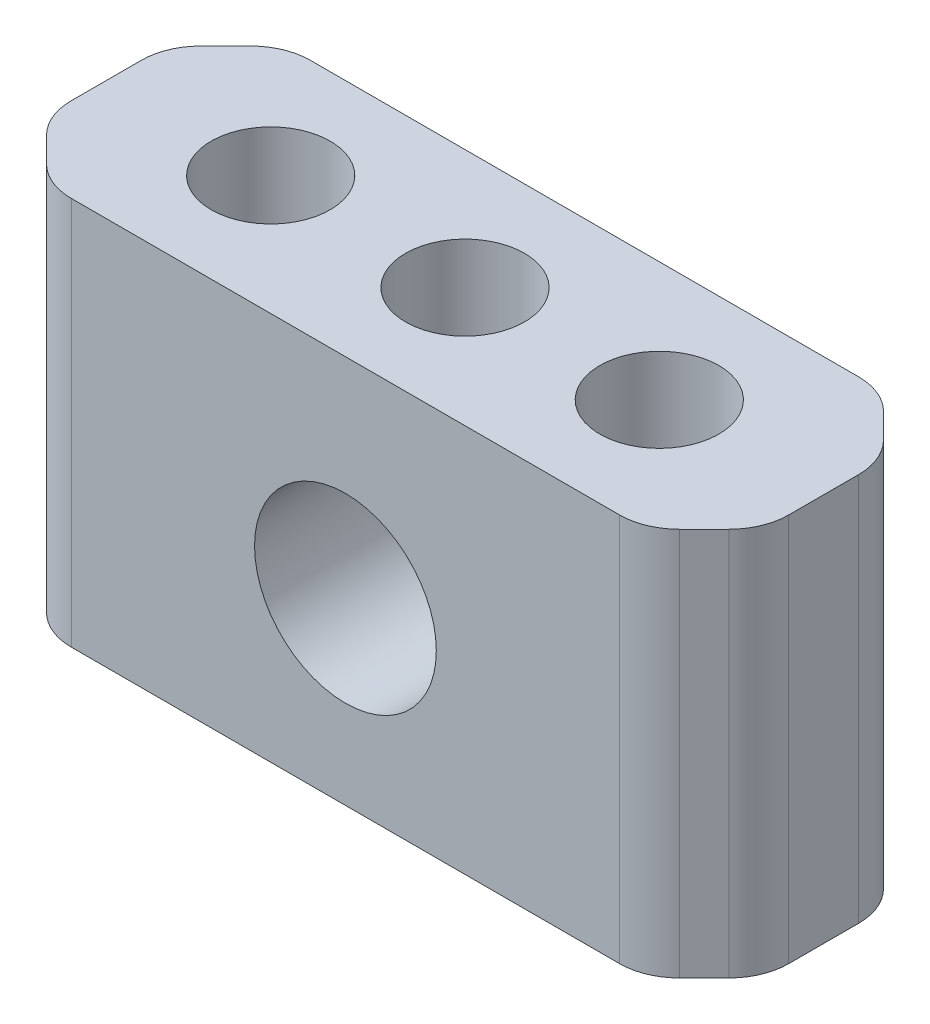
ISO-10303-21;
HEADER;
FILE_DESCRIPTION(('STEP AP214'),'2;1');
FILE_NAME('part.step','',(''),(''),'','','');
FILE_SCHEMA(('AUTOMOTIVE_DESIGN { 1 0 10303 214 1 1 1 1 }'));
ENDSEC;
DATA;
#1=APPLICATION_CONTEXT('core data for automotive mechanical design processes');
#2=APPLICATION_PROTOCOL_DEFINITION('international standard','automotive_design',2000,#1);
#3=PRODUCT_CONTEXT('',#1,'mechanical');
#4=PRODUCT('Part','Part','',(#3));
#5=PRODUCT_RELATED_PRODUCT_CATEGORY('part','',(#4));
#6=PRODUCT_DEFINITION_FORMATION('','',#4);
#7=PRODUCT_DEFINITION_CONTEXT('part definition',#1,'design');
#8=PRODUCT_DEFINITION('design','',#6,#7);
#9=PRODUCT_DEFINITION_SHAPE('','',#8);
#10=(LENGTH_UNIT() NAMED_UNIT(*) SI_UNIT(.MILLI.,.METRE.));
#11=(NAMED_UNIT(*) PLANE_ANGLE_UNIT() SI_UNIT($,.RADIAN.));
#12=(NAMED_UNIT(*) SI_UNIT($,.STERADIAN.) SOLID_ANGLE_UNIT());
#13=UNCERTAINTY_MEASURE_WITH_UNIT(LENGTH_MEASURE(1.E-05),#10,'distance_accuracy_value','');
#14=(GEOMETRIC_REPRESENTATION_CONTEXT(3) GLOBAL_UNCERTAINTY_ASSIGNED_CONTEXT((#13)) GLOBAL_UNIT_ASSIGNED_CONTEXT((#10,
#11,#12)) REPRESENTATION_CONTEXT('',''));
#15=CARTESIAN_POINT('',(0.,0.,0.));
#16=DIRECTION('',(0.,0.,1.));
#17=DIRECTION('',(1.,0.,0.));
#18=AXIS2_PLACEMENT_3D('',#15,#16,#17);
#19=CARTESIAN_POINT('',(-12.,6.5,-4.));
#20=DIRECTION('',(0.,0.,1.));
#21=DIRECTION('',(1.,0.,0.));
#22=AXIS2_PLACEMENT_3D('',#19,#20,#21);
#23=PLANE('',#22);
#24=DIRECTION('',(1.,0.,0.));
#25=VECTOR('',#24,1.);
#26=CARTESIAN_POINT('',(12.,-6.5,-4.));
#27=LINE('',#26,#25);
#28=CARTESIAN_POINT('',(-9.17157287525381,-6.5,-4.));
#29=VERTEX_POINT('',#28);
#30=CARTESIAN_POINT('',(9.1715728752538,-6.5,-4.));
#31=VERTEX_POINT('',#30);
#32=EDGE_CURVE('E176',#29,#31,#27,.T.);
#33=ORIENTED_EDGE('',*,*,#32,.F.);
#34=DIRECTION('',(0.,1.,0.));
#35=VECTOR('',#34,1.);
#36=CARTESIAN_POINT('',(-9.17157287525381,6.5,-4.));
#37=LINE('',#36,#35);
#38=CARTESIAN_POINT('',(-9.17157287525381,6.5,-4.));
#39=VERTEX_POINT('',#38);
#40=EDGE_CURVE('E270',#29,#39,#37,.T.);
#41=ORIENTED_EDGE('',*,*,#40,.T.);
#42=DIRECTION('',(-1.,0.,0.));
#43=VECTOR('',#42,1.);
#44=CARTESIAN_POINT('',(12.,6.5,-4.));
#45=LINE('',#44,#43);
#46=CARTESIAN_POINT('',(9.1715728752538,6.5,-4.));
#47=VERTEX_POINT('',#46);
#48=EDGE_CURVE('E184',#47,#39,#45,.T.);
#49=ORIENTED_EDGE('',*,*,#48,.F.);
#50=DIRECTION('',(0.,-1.,0.));
#51=VECTOR('',#50,1.);
#52=CARTESIAN_POINT('',(9.1715728752538,-6.5,-4.));
#53=LINE('',#52,#51);
#54=EDGE_CURVE('E267',#47,#31,#53,.T.);
#55=ORIENTED_EDGE('',*,*,#54,.T.);
#56=EDGE_LOOP('',(#33,#41,#49,#55));
#57=FACE_BOUND('',#56,.T.);
#58=CARTESIAN_POINT('',(0.,-0.5,-4.));
#59=DIRECTION('',(0.,0.,1.));
#60=DIRECTION('',(1.,0.,0.));
#61=AXIS2_PLACEMENT_3D('',#58,#59,#60);
#62=CIRCLE('',#61,3.04);
#63=CARTESIAN_POINT('',(3.04,-0.5,-4.));
#64=VERTEX_POINT('',#63);
#65=EDGE_CURVE('E174',#64,#64,#62,.F.);
#66=ORIENTED_EDGE('',*,*,#65,.F.);
#67=EDGE_LOOP('',(#66));
#68=FACE_BOUND('',#67,.T.);
#69=ADVANCED_FACE('F34',(#57,#68),#23,.F.);
#70=CARTESIAN_POINT('',(-12.,6.5,4.));
#71=DIRECTION('',(0.,0.,1.));
#72=DIRECTION('',(1.,0.,0.));
#73=AXIS2_PLACEMENT_3D('',#70,#71,#72);
#74=PLANE('',#73);
#75=DIRECTION('',(1.,0.,0.));
#76=VECTOR('',#75,1.);
#77=CARTESIAN_POINT('',(12.,-6.5,4.));
#78=LINE('',#77,#76);
#79=CARTESIAN_POINT('',(-9.17157287525381,-6.5,4.));
#80=VERTEX_POINT('',#79);
#81=CARTESIAN_POINT('',(9.17157287525381,-6.5,4.));
#82=VERTEX_POINT('',#81);
#83=EDGE_CURVE('E164',#80,#82,#78,.T.);
#84=ORIENTED_EDGE('',*,*,#83,.T.);
#85=DIRECTION('',(0.,-1.,0.));
#86=VECTOR('',#85,1.);
#87=CARTESIAN_POINT('',(9.17157287525381,6.5,4.));
#88=LINE('',#87,#86);
#89=CARTESIAN_POINT('',(9.17157287525381,6.5,4.));
#90=VERTEX_POINT('',#89);
#91=EDGE_CURVE('E168',#82,#90,#88,.F.);
#92=ORIENTED_EDGE('',*,*,#91,.T.);
#93=DIRECTION('',(-1.,0.,0.));
#94=VECTOR('',#93,1.);
#95=CARTESIAN_POINT('',(12.,6.5,4.));
#96=LINE('',#95,#94);
#97=CARTESIAN_POINT('',(-9.17157287525381,6.5,4.));
#98=VERTEX_POINT('',#97);
#99=EDGE_CURVE('E167',#90,#98,#96,.T.);
#100=ORIENTED_EDGE('',*,*,#99,.T.);
#101=DIRECTION('',(0.,1.,0.));
#102=VECTOR('',#101,1.);
#103=CARTESIAN_POINT('',(-9.17157287525381,6.5,4.));
#104=LINE('',#103,#102);
#105=EDGE_CURVE('E150',#98,#80,#104,.F.);
#106=ORIENTED_EDGE('',*,*,#105,.T.);
#107=EDGE_LOOP('',(#84,#92,#100,#106));
#108=FACE_BOUND('',#107,.T.);
#109=CARTESIAN_POINT('',(0.,-0.5,4.));
#110=DIRECTION('',(0.,0.,1.));
#111=DIRECTION('',(1.,0.,0.));
#112=AXIS2_PLACEMENT_3D('',#109,#110,#111);
#113=CIRCLE('',#112,3.04);
#114=CARTESIAN_POINT('',(3.04,-0.5,4.));
#115=VERTEX_POINT('',#114);
#116=EDGE_CURVE('E179',#115,#115,#113,.F.);
#117=ORIENTED_EDGE('',*,*,#116,.T.);
#118=EDGE_LOOP('',(#117));
#119=FACE_BOUND('',#118,.T.);
#120=ADVANCED_FACE('F161',(#108,#119),#74,.T.);
#121=CARTESIAN_POINT('',(-12.,-6.5,-4.));
#122=DIRECTION('',(-1.,0.,0.));
#123=DIRECTION('',(0.,0.,1.));
#124=AXIS2_PLACEMENT_3D('',#121,#122,#123);
#125=PLANE('',#124);
#126=DIRECTION('',(0.,0.,1.));
#127=VECTOR('',#126,1.);
#128=CARTESIAN_POINT('',(-12.,-6.5,-4.));
#129=LINE('',#128,#127);
#130=CARTESIAN_POINT('',(-12.,-6.5,-1.17157287525381));
#131=VERTEX_POINT('',#130);
#132=CARTESIAN_POINT('',(-12.,-6.5,1.1715728752538));
#133=VERTEX_POINT('',#132);
#134=EDGE_CURVE('E187',#131,#133,#129,.T.);
#135=ORIENTED_EDGE('',*,*,#134,.T.);
#136=DIRECTION('',(0.,-1.,0.));
#137=VECTOR('',#136,1.);
#138=CARTESIAN_POINT('',(-12.,-6.5,1.1715728752538));
#139=LINE('',#138,#137);
#140=CARTESIAN_POINT('',(-12.,6.5,1.1715728752538));
#141=VERTEX_POINT('',#140);
#142=EDGE_CURVE('E260',#133,#141,#139,.F.);
#143=ORIENTED_EDGE('',*,*,#142,.T.);
#144=DIRECTION('',(0.,0.,1.));
#145=VECTOR('',#144,1.);
#146=CARTESIAN_POINT('',(-12.,6.5,-4.));
#147=LINE('',#146,#145);
#148=CARTESIAN_POINT('',(-12.,6.5,-1.17157287525381));
#149=VERTEX_POINT('',#148);
#150=EDGE_CURVE('E188',#149,#141,#147,.T.);
#151=ORIENTED_EDGE('',*,*,#150,.F.);
#152=DIRECTION('',(0.,-1.,0.));
#153=VECTOR('',#152,1.);
#154=CARTESIAN_POINT('',(-12.,-6.5,-1.17157287525381));
#155=LINE('',#154,#153);
#156=EDGE_CURVE('E257',#149,#131,#155,.T.);
#157=ORIENTED_EDGE('',*,*,#156,.T.);
#158=EDGE_LOOP('',(#135,#143,#151,#157));
#159=FACE_BOUND('',#158,.T.);
#160=ADVANCED_FACE('F306',(#159),#125,.T.);
#161=CARTESIAN_POINT('',(12.,6.5,-4.));
#162=DIRECTION('',(0.,1.,0.));
#163=DIRECTION('',(-1.,0.,0.));
#164=AXIS2_PLACEMENT_3D('',#161,#162,#163);
#165=PLANE('',#164);
#166=CARTESIAN_POINT('',(0.,6.5,0.));
#167=DIRECTION('',(0.,1.,0.));
#168=DIRECTION('',(-1.,0.,0.));
#169=AXIS2_PLACEMENT_3D('',#166,#167,#168);
#170=CIRCLE('',#169,1.99);
#171=CARTESIAN_POINT('',(-1.99,6.5,0.));
#172=VERTEX_POINT('',#171);
#173=EDGE_CURVE('E567',#172,#172,#170,.T.);
#174=ORIENTED_EDGE('',*,*,#173,.F.);
#175=EDGE_LOOP('',(#174));
#176=FACE_BOUND('',#175,.T.);
#177=CARTESIAN_POINT('',(6.5,6.5,0.));
#178=DIRECTION('',(0.,1.,0.));
#179=DIRECTION('',(0.,0.,-1.));
#180=AXIS2_PLACEMENT_3D('',#177,#178,#179);
#181=CIRCLE('',#180,1.99);
#182=CARTESIAN_POINT('',(6.5,6.5,-1.99));
#183=VERTEX_POINT('',#182);
#184=EDGE_CURVE('E561',#183,#183,#181,.T.);
#185=ORIENTED_EDGE('',*,*,#184,.F.);
#186=EDGE_LOOP('',(#185));
#187=FACE_BOUND('',#186,.T.);
#188=CARTESIAN_POINT('',(-6.5,6.5,0.));
#189=DIRECTION('',(0.,1.,0.));
#190=DIRECTION('',(0.,0.,1.));
#191=AXIS2_PLACEMENT_3D('',#188,#189,#190);
#192=CIRCLE('',#191,1.99);
#193=CARTESIAN_POINT('',(-6.5,6.5,1.99));
#194=VERTEX_POINT('',#193);
#195=EDGE_CURVE('E556',#194,#194,#192,.T.);
#196=ORIENTED_EDGE('',*,*,#195,.F.);
#197=EDGE_LOOP('',(#196));
#198=FACE_BOUND('',#197,.T.);
#199=ORIENTED_EDGE('',*,*,#99,.F.);
#200=CARTESIAN_POINT('',(9.17157287525381,6.5,2.));
#201=DIRECTION('',(0.,1.,0.));
#202=DIRECTION('',(-1.,0.,0.));
#203=AXIS2_PLACEMENT_3D('',#200,#201,#202);
#204=CIRCLE('',#203,2.);
#205=CARTESIAN_POINT('',(10.5857864376269,6.5,3.41421356237309));
#206=VERTEX_POINT('',#205);
#207=EDGE_CURVE('E237',#90,#206,#204,.T.);
#208=ORIENTED_EDGE('',*,*,#207,.T.);
#209=DIRECTION('',(-0.707106781186546,0.,0.707106781186549));
#210=VECTOR('',#209,1.);
#211=CARTESIAN_POINT('',(15.,6.5,-1.00000000000001));
#212=LINE('',#211,#210);
#213=CARTESIAN_POINT('',(11.4142135623731,6.5,2.5857864376269));
#214=VERTEX_POINT('',#213);
#215=EDGE_CURVE('E211',#206,#214,#212,.F.);
#216=ORIENTED_EDGE('',*,*,#215,.T.);
#217=CARTESIAN_POINT('',(10.,6.5,1.17157287525381));
#218=DIRECTION('',(0.,1.,0.));
#219=DIRECTION('',(-1.,0.,0.));
#220=AXIS2_PLACEMENT_3D('',#217,#218,#219);
#221=CIRCLE('',#220,2.);
#222=CARTESIAN_POINT('',(12.,6.5,1.17157287525381));
#223=VERTEX_POINT('',#222);
#224=EDGE_CURVE('E227',#214,#223,#221,.T.);
#225=ORIENTED_EDGE('',*,*,#224,.T.);
#226=DIRECTION('',(0.,0.,1.));
#227=VECTOR('',#226,1.);
#228=CARTESIAN_POINT('',(12.,6.5,-4.));
#229=LINE('',#228,#227);
#230=CARTESIAN_POINT('',(12.,6.5,-1.17157287525381));
#231=VERTEX_POINT('',#230);
#232=EDGE_CURVE('E192',#231,#223,#229,.T.);
#233=ORIENTED_EDGE('',*,*,#232,.F.);
#234=CARTESIAN_POINT('',(10.,6.5,-1.17157287525381));
#235=DIRECTION('',(0.,1.,0.));
#236=DIRECTION('',(-1.,0.,0.));
#237=AXIS2_PLACEMENT_3D('',#234,#235,#236);
#238=CIRCLE('',#237,2.);
#239=CARTESIAN_POINT('',(11.4142135623731,6.5,-2.5857864376269));
#240=VERTEX_POINT('',#239);
#241=EDGE_CURVE('E225',#231,#240,#238,.T.);
#242=ORIENTED_EDGE('',*,*,#241,.T.);
#243=DIRECTION('',(-0.707106781186549,0.,-0.707106781186546));
#244=VECTOR('',#243,1.);
#245=CARTESIAN_POINT('',(11.,6.5,-3.));
#246=LINE('',#245,#244);
#247=CARTESIAN_POINT('',(10.5857864376269,6.5,-3.4142135623731));
#248=VERTEX_POINT('',#247);
#249=EDGE_CURVE('E208',#240,#248,#246,.T.);
#250=ORIENTED_EDGE('',*,*,#249,.T.);
#251=CARTESIAN_POINT('',(9.1715728752538,6.5,-2.));
#252=DIRECTION('',(0.,1.,0.));
#253=DIRECTION('',(-1.,0.,0.));
#254=AXIS2_PLACEMENT_3D('',#251,#252,#253);
#255=CIRCLE('',#254,2.);
#256=EDGE_CURVE('E223',#248,#47,#255,.T.);
#257=ORIENTED_EDGE('',*,*,#256,.T.);
#258=ORIENTED_EDGE('',*,*,#48,.T.);
#259=CARTESIAN_POINT('',(-9.17157287525381,6.5,-2.));
#260=DIRECTION('',(0.,1.,0.));
#261=DIRECTION('',(-1.,0.,0.));
#262=AXIS2_PLACEMENT_3D('',#259,#260,#261);
#263=CIRCLE('',#262,2.);
#264=CARTESIAN_POINT('',(-10.5857864376269,6.5,-3.4142135623731));
#265=VERTEX_POINT('',#264);
#266=EDGE_CURVE('E229',#39,#265,#263,.T.);
#267=ORIENTED_EDGE('',*,*,#266,.T.);
#268=DIRECTION('',(-0.707106781186549,0.,0.707106781186546));
#269=VECTOR('',#268,1.);
#270=CARTESIAN_POINT('',(1.00000000000004,6.5,-15.));
#271=LINE('',#270,#269);
#272=CARTESIAN_POINT('',(-11.4142135623731,6.5,-2.5857864376269));
#273=VERTEX_POINT('',#272);
#274=EDGE_CURVE('E191',#265,#273,#271,.T.);
#275=ORIENTED_EDGE('',*,*,#274,.T.);
#276=CARTESIAN_POINT('',(-10.,6.5,-1.17157287525381));
#277=DIRECTION('',(0.,1.,0.));
#278=DIRECTION('',(-1.,0.,0.));
#279=AXIS2_PLACEMENT_3D('',#276,#277,#278);
#280=CIRCLE('',#279,2.);
#281=EDGE_CURVE('E231',#273,#149,#280,.T.);
#282=ORIENTED_EDGE('',*,*,#281,.T.);
#283=ORIENTED_EDGE('',*,*,#150,.T.);
#284=CARTESIAN_POINT('',(-10.,6.5,1.1715728752538));
#285=DIRECTION('',(0.,1.,0.));
#286=DIRECTION('',(-1.,0.,0.));
#287=AXIS2_PLACEMENT_3D('',#284,#285,#286);
#288=CIRCLE('',#287,2.);
#289=CARTESIAN_POINT('',(-11.4142135623731,6.5,2.58578643762689));
#290=VERTEX_POINT('',#289);
#291=EDGE_CURVE('E233',#141,#290,#288,.T.);
#292=ORIENTED_EDGE('',*,*,#291,.T.);
#293=DIRECTION('',(-0.707106781186546,0.,-0.707106781186549));
#294=VECTOR('',#293,1.);
#295=CARTESIAN_POINT('',(-3.00000000000004,6.5,11.));
#296=LINE('',#295,#294);
#297=CARTESIAN_POINT('',(-10.5857864376269,6.5,3.41421356237309));
#298=VERTEX_POINT('',#297);
#299=EDGE_CURVE('E205',#290,#298,#296,.F.);
#300=ORIENTED_EDGE('',*,*,#299,.T.);
#301=CARTESIAN_POINT('',(-9.17157287525381,6.5,2.));
#302=DIRECTION('',(0.,1.,0.));
#303=DIRECTION('',(-1.,0.,0.));
#304=AXIS2_PLACEMENT_3D('',#301,#302,#303);
#305=CIRCLE('',#304,2.);
#306=EDGE_CURVE('E235',#298,#98,#305,.T.);
#307=ORIENTED_EDGE('',*,*,#306,.T.);
#308=EDGE_LOOP('',(#199,#208,#216,#225,#233,#242,#250,#257,#258,#267,#275,#282,#283,#292,#300,#307));
#309=FACE_BOUND('',#308,.T.);
#310=ADVANCED_FACE('F283',(#176,#187,#198,#309),#165,.T.);
#311=CARTESIAN_POINT('',(12.,-6.5,-4.));
#312=DIRECTION('',(1.,0.,0.));
#313=DIRECTION('',(0.,0.,-1.));
#314=AXIS2_PLACEMENT_3D('',#311,#312,#313);
#315=PLANE('',#314);
#316=ORIENTED_EDGE('',*,*,#232,.T.);
#317=DIRECTION('',(0.,1.,0.));
#318=VECTOR('',#317,1.);
#319=CARTESIAN_POINT('',(12.,-6.5,1.17157287525381));
#320=LINE('',#319,#318);
#321=CARTESIAN_POINT('',(12.,-6.5,1.17157287525381));
#322=VERTEX_POINT('',#321);
#323=EDGE_CURVE('E276',#223,#322,#320,.F.);
#324=ORIENTED_EDGE('',*,*,#323,.T.);
#325=DIRECTION('',(0.,0.,1.));
#326=VECTOR('',#325,1.);
#327=CARTESIAN_POINT('',(12.,-6.5,-4.));
#328=LINE('',#327,#326);
#329=CARTESIAN_POINT('',(12.,-6.5,-1.17157287525381));
#330=VERTEX_POINT('',#329);
#331=EDGE_CURVE('E195',#330,#322,#328,.T.);
#332=ORIENTED_EDGE('',*,*,#331,.F.);
#333=DIRECTION('',(0.,1.,0.));
#334=VECTOR('',#333,1.);
#335=CARTESIAN_POINT('',(12.,-6.5,-1.17157287525381));
#336=LINE('',#335,#334);
#337=EDGE_CURVE('E273',#330,#231,#336,.T.);
#338=ORIENTED_EDGE('',*,*,#337,.T.);
#339=EDGE_LOOP('',(#316,#324,#332,#338));
#340=FACE_BOUND('',#339,.T.);
#341=ADVANCED_FACE('F336',(#340),#315,.T.);
#342=CARTESIAN_POINT('',(12.,-6.5,-4.));
#343=DIRECTION('',(0.,-1.,0.));
#344=DIRECTION('',(1.,0.,0.));
#345=AXIS2_PLACEMENT_3D('',#342,#343,#344);
#346=PLANE('',#345);
#347=DIRECTION('',(0.707106781186546,0.,-0.707106781186549));
#348=VECTOR('',#347,1.);
#349=CARTESIAN_POINT('',(15.,-6.5,-1.00000000000001));
#350=LINE('',#349,#348);
#351=CARTESIAN_POINT('',(11.4142135623731,-6.5,2.5857864376269));
#352=VERTEX_POINT('',#351);
#353=CARTESIAN_POINT('',(10.5857864376269,-6.5,3.41421356237309));
#354=VERTEX_POINT('',#353);
#355=EDGE_CURVE('E169',#352,#354,#350,.F.);
#356=ORIENTED_EDGE('',*,*,#355,.T.);
#357=CARTESIAN_POINT('',(9.17157287525381,-6.5,2.));
#358=DIRECTION('',(0.,-1.,0.));
#359=DIRECTION('',(1.,0.,0.));
#360=AXIS2_PLACEMENT_3D('',#357,#358,#359);
#361=CIRCLE('',#360,2.);
#362=EDGE_CURVE('E155',#354,#82,#361,.T.);
#363=ORIENTED_EDGE('',*,*,#362,.T.);
#364=ORIENTED_EDGE('',*,*,#83,.F.);
#365=CARTESIAN_POINT('',(-9.17157287525381,-6.5,2.));
#366=DIRECTION('',(0.,-1.,0.));
#367=DIRECTION('',(1.,0.,0.));
#368=AXIS2_PLACEMENT_3D('',#365,#366,#367);
#369=CIRCLE('',#368,2.);
#370=CARTESIAN_POINT('',(-10.5857864376269,-6.5,3.41421356237309));
#371=VERTEX_POINT('',#370);
#372=EDGE_CURVE('E146',#80,#371,#369,.T.);
#373=ORIENTED_EDGE('',*,*,#372,.T.);
#374=DIRECTION('',(0.707106781186546,0.,0.707106781186549));
#375=VECTOR('',#374,1.);
#376=CARTESIAN_POINT('',(-3.00000000000004,-6.5,11.));
#377=LINE('',#376,#375);
#378=CARTESIAN_POINT('',(-11.4142135623731,-6.5,2.58578643762689));
#379=VERTEX_POINT('',#378);
#380=EDGE_CURVE('E217',#371,#379,#377,.F.);
#381=ORIENTED_EDGE('',*,*,#380,.T.);
#382=CARTESIAN_POINT('',(-10.,-6.5,1.1715728752538));
#383=DIRECTION('',(0.,-1.,0.));
#384=DIRECTION('',(1.,0.,0.));
#385=AXIS2_PLACEMENT_3D('',#382,#383,#384);
#386=CIRCLE('',#385,2.);
#387=EDGE_CURVE('E156',#379,#133,#386,.T.);
#388=ORIENTED_EDGE('',*,*,#387,.T.);
#389=ORIENTED_EDGE('',*,*,#134,.F.);
#390=CARTESIAN_POINT('',(-10.,-6.5,-1.17157287525381));
#391=DIRECTION('',(0.,-1.,0.));
#392=DIRECTION('',(1.,0.,0.));
#393=AXIS2_PLACEMENT_3D('',#390,#391,#392);
#394=CIRCLE('',#393,2.);
#395=CARTESIAN_POINT('',(-11.4142135623731,-6.5,-2.5857864376269));
#396=VERTEX_POINT('',#395);
#397=EDGE_CURVE('E250',#131,#396,#394,.T.);
#398=ORIENTED_EDGE('',*,*,#397,.T.);
#399=DIRECTION('',(0.707106781186549,0.,-0.707106781186546));
#400=VECTOR('',#399,1.);
#401=CARTESIAN_POINT('',(1.00000000000004,-6.5,-15.));
#402=LINE('',#401,#400);
#403=CARTESIAN_POINT('',(-10.5857864376269,-6.5,-3.4142135623731));
#404=VERTEX_POINT('',#403);
#405=EDGE_CURVE('E214',#396,#404,#402,.T.);
#406=ORIENTED_EDGE('',*,*,#405,.T.);
#407=CARTESIAN_POINT('',(-9.17157287525381,-6.5,-2.));
#408=DIRECTION('',(0.,-1.,0.));
#409=DIRECTION('',(1.,0.,0.));
#410=AXIS2_PLACEMENT_3D('',#407,#408,#409);
#411=CIRCLE('',#410,2.);
#412=EDGE_CURVE('E248',#404,#29,#411,.T.);
#413=ORIENTED_EDGE('',*,*,#412,.T.);
#414=ORIENTED_EDGE('',*,*,#32,.T.);
#415=CARTESIAN_POINT('',(9.1715728752538,-6.5,-2.));
#416=DIRECTION('',(0.,-1.,0.));
#417=DIRECTION('',(1.,0.,0.));
#418=AXIS2_PLACEMENT_3D('',#415,#416,#417);
#419=CIRCLE('',#418,2.);
#420=CARTESIAN_POINT('',(10.5857864376269,-6.5,-3.4142135623731));
#421=VERTEX_POINT('',#420);
#422=EDGE_CURVE('E54',#31,#421,#419,.T.);
#423=ORIENTED_EDGE('',*,*,#422,.T.);
#424=DIRECTION('',(0.707106781186549,0.,0.707106781186546));
#425=VECTOR('',#424,1.);
#426=CARTESIAN_POINT('',(11.,-6.5,-3.));
#427=LINE('',#426,#425);
#428=CARTESIAN_POINT('',(11.4142135623731,-6.5,-2.5857864376269));
#429=VERTEX_POINT('',#428);
#430=EDGE_CURVE('E219',#421,#429,#427,.T.);
#431=ORIENTED_EDGE('',*,*,#430,.T.);
#432=CARTESIAN_POINT('',(10.,-6.5,-1.17157287525381));
#433=DIRECTION('',(0.,-1.,0.));
#434=DIRECTION('',(1.,0.,0.));
#435=AXIS2_PLACEMENT_3D('',#432,#433,#434);
#436=CIRCLE('',#435,2.);
#437=EDGE_CURVE('E244',#429,#330,#436,.T.);
#438=ORIENTED_EDGE('',*,*,#437,.T.);
#439=ORIENTED_EDGE('',*,*,#331,.T.);
#440=CARTESIAN_POINT('',(10.,-6.5,1.17157287525381));
#441=DIRECTION('',(0.,-1.,0.));
#442=DIRECTION('',(1.,0.,0.));
#443=AXIS2_PLACEMENT_3D('',#440,#441,#442);
#444=CIRCLE('',#443,2.);
#445=EDGE_CURVE('E246',#322,#352,#444,.T.);
#446=ORIENTED_EDGE('',*,*,#445,.T.);
#447=EDGE_LOOP('',(#356,#363,#364,#373,#381,#388,#389,#398,#406,#413,#414,#423,#431,#438,#439,#446));
#448=FACE_BOUND('',#447,.T.);
#449=ADVANCED_FACE('F172',(#448),#346,.T.);
#450=CARTESIAN_POINT('',(0.,-0.5,7.));
#451=DIRECTION('',(0.,0.,-1.));
#452=DIRECTION('',(-1.,0.,0.));
#453=AXIS2_PLACEMENT_3D('',#450,#451,#452);
#454=CYLINDRICAL_SURFACE('',#453,3.04);
#455=ORIENTED_EDGE('',*,*,#116,.F.);
#456=EDGE_LOOP('',(#455));
#457=FACE_BOUND('',#456,.T.);
#458=ORIENTED_EDGE('',*,*,#65,.T.);
#459=EDGE_LOOP('',(#458));
#460=FACE_BOUND('',#459,.T.);
#461=ADVANCED_FACE('F343',(#457,#460),#454,.F.);
#462=CARTESIAN_POINT('',(-6.5,-3.5,0.));
#463=DIRECTION('',(0.,1.,0.));
#464=DIRECTION('',(0.,0.,1.));
#465=AXIS2_PLACEMENT_3D('',#462,#463,#464);
#466=CYLINDRICAL_SURFACE('',#465,1.99);
#467=CARTESIAN_POINT('',(-6.5,-3.5,0.));
#468=DIRECTION('',(0.,1.,0.));
#469=DIRECTION('',(0.,0.,1.));
#470=AXIS2_PLACEMENT_3D('',#467,#468,#469);
#471=CIRCLE('',#470,1.99);
#472=CARTESIAN_POINT('',(-6.5,-3.5,1.99));
#473=VERTEX_POINT('',#472);
#474=EDGE_CURVE('E202',#473,#473,#471,.T.);
#475=ORIENTED_EDGE('',*,*,#474,.F.);
#476=EDGE_LOOP('',(#475));
#477=FACE_BOUND('',#476,.T.);
#478=ORIENTED_EDGE('',*,*,#195,.T.);
#479=EDGE_LOOP('',(#478));
#480=FACE_BOUND('',#479,.T.);
#481=ADVANCED_FACE('F528',(#477,#480),#466,.F.);
#482=CARTESIAN_POINT('',(-6.5,-3.5,0.));
#483=DIRECTION('',(0.,1.,0.));
#484=DIRECTION('',(0.,0.,1.));
#485=AXIS2_PLACEMENT_3D('',#482,#483,#484);
#486=PLANE('',#485);
#487=ORIENTED_EDGE('',*,*,#474,.T.);
#488=EDGE_LOOP('',(#487));
#489=FACE_BOUND('',#488,.T.);
#490=ADVANCED_FACE('F518',(#489),#486,.T.);
#491=CARTESIAN_POINT('',(6.5,-3.5,0.));
#492=DIRECTION('',(0.,1.,0.));
#493=DIRECTION('',(0.,0.,1.));
#494=AXIS2_PLACEMENT_3D('',#491,#492,#493);
#495=CYLINDRICAL_SURFACE('',#494,1.99);
#496=CARTESIAN_POINT('',(6.5,-3.5,0.));
#497=DIRECTION('',(0.,1.,0.));
#498=DIRECTION('',(0.,0.,-1.));
#499=AXIS2_PLACEMENT_3D('',#496,#497,#498);
#500=CIRCLE('',#499,1.99);
#501=CARTESIAN_POINT('',(6.5,-3.5,-1.99));
#502=VERTEX_POINT('',#501);
#503=EDGE_CURVE('E558',#502,#502,#500,.T.);
#504=ORIENTED_EDGE('',*,*,#503,.F.);
#505=EDGE_LOOP('',(#504));
#506=FACE_BOUND('',#505,.T.);
#507=ORIENTED_EDGE('',*,*,#184,.T.);
#508=EDGE_LOOP('',(#507));
#509=FACE_BOUND('',#508,.T.);
#510=ADVANCED_FACE('F508',(#506,#509),#495,.F.);
#511=CARTESIAN_POINT('',(6.5,-3.5,0.));
#512=DIRECTION('',(0.,-1.,0.));
#513=DIRECTION('',(0.,0.,-1.));
#514=AXIS2_PLACEMENT_3D('',#511,#512,#513);
#515=PLANE('',#514);
#516=ORIENTED_EDGE('',*,*,#503,.T.);
#517=EDGE_LOOP('',(#516));
#518=FACE_BOUND('',#517,.T.);
#519=ADVANCED_FACE('F498',(#518),#515,.F.);
#520=CARTESIAN_POINT('',(0.,2.6,0.));
#521=DIRECTION('',(0.,1.,0.));
#522=DIRECTION('',(-1.,0.,0.));
#523=AXIS2_PLACEMENT_3D('',#520,#521,#522);
#524=CYLINDRICAL_SURFACE('',#523,1.99);
#525=CARTESIAN_POINT('',(0.,2.6,0.));
#526=DIRECTION('',(0.,1.,0.));
#527=DIRECTION('',(-1.,0.,0.));
#528=AXIS2_PLACEMENT_3D('',#525,#526,#527);
#529=CIRCLE('',#528,1.99);
#530=CARTESIAN_POINT('',(-1.99,2.6,0.));
#531=VERTEX_POINT('',#530);
#532=EDGE_CURVE('E565',#531,#531,#529,.T.);
#533=ORIENTED_EDGE('',*,*,#532,.F.);
#534=EDGE_LOOP('',(#533));
#535=FACE_BOUND('',#534,.T.);
#536=ORIENTED_EDGE('',*,*,#173,.T.);
#537=EDGE_LOOP('',(#536));
#538=FACE_BOUND('',#537,.T.);
#539=ADVANCED_FACE('F352',(#535,#538),#524,.F.);
#540=CARTESIAN_POINT('',(0.,2.6,0.));
#541=DIRECTION('',(0.,1.,0.));
#542=DIRECTION('',(-1.,0.,0.));
#543=AXIS2_PLACEMENT_3D('',#540,#541,#542);
#544=PLANE('',#543);
#545=ORIENTED_EDGE('',*,*,#532,.T.);
#546=EDGE_LOOP('',(#545));
#547=FACE_BOUND('',#546,.T.);
#548=ADVANCED_FACE('F347',(#547),#544,.T.);
#549=CARTESIAN_POINT('',(10.,6.5,4.));
#550=DIRECTION('',(-0.707106781186549,0.,-0.707106781186546));
#551=DIRECTION('',(-0.707106781186546,0.,0.707106781186549));
#552=AXIS2_PLACEMENT_3D('',#549,#550,#551);
#553=PLANE('',#552);
#554=ORIENTED_EDGE('',*,*,#215,.F.);
#555=DIRECTION('',(0.,1.,0.));
#556=VECTOR('',#555,1.);
#557=CARTESIAN_POINT('',(10.5857864376269,6.5,3.41421356237309));
#558=LINE('',#557,#556);
#559=EDGE_CURVE('E241',#206,#354,#558,.F.);
#560=ORIENTED_EDGE('',*,*,#559,.T.);
#561=ORIENTED_EDGE('',*,*,#355,.F.);
#562=DIRECTION('',(0.,-1.,0.));
#563=VECTOR('',#562,1.);
#564=CARTESIAN_POINT('',(11.4142135623731,6.5,2.5857864376269));
#565=LINE('',#564,#563);
#566=EDGE_CURVE('E239',#352,#214,#565,.F.);
#567=ORIENTED_EDGE('',*,*,#566,.T.);
#568=EDGE_LOOP('',(#554,#560,#561,#567));
#569=FACE_BOUND('',#568,.T.);
#570=ADVANCED_FACE('F324',(#569),#553,.F.);
#571=CARTESIAN_POINT('',(12.,-6.5,-2.));
#572=DIRECTION('',(0.707106781186546,0.,-0.707106781186549));
#573=DIRECTION('',(-0.707106781186549,0.,-0.707106781186546));
#574=AXIS2_PLACEMENT_3D('',#571,#572,#573);
#575=PLANE('',#574);
#576=ORIENTED_EDGE('',*,*,#249,.F.);
#577=DIRECTION('',(0.,1.,0.));
#578=VECTOR('',#577,1.);
#579=CARTESIAN_POINT('',(11.4142135623731,-6.5,-2.5857864376269));
#580=LINE('',#579,#578);
#581=EDGE_CURVE('E11',#240,#429,#580,.F.);
#582=ORIENTED_EDGE('',*,*,#581,.T.);
#583=ORIENTED_EDGE('',*,*,#430,.F.);
#584=DIRECTION('',(0.,-1.,0.));
#585=VECTOR('',#584,1.);
#586=CARTESIAN_POINT('',(10.5857864376269,6.5,-3.4142135623731));
#587=LINE('',#586,#585);
#588=EDGE_CURVE('E42',#421,#248,#587,.F.);
#589=ORIENTED_EDGE('',*,*,#588,.T.);
#590=EDGE_LOOP('',(#576,#582,#583,#589));
#591=FACE_BOUND('',#590,.T.);
#592=ADVANCED_FACE('F279',(#591),#575,.T.);
#593=CARTESIAN_POINT('',(-10.,6.5,4.));
#594=DIRECTION('',(0.707106781186549,0.,-0.707106781186546));
#595=DIRECTION('',(-0.707106781186546,0.,-0.707106781186549));
#596=AXIS2_PLACEMENT_3D('',#593,#594,#595);
#597=PLANE('',#596);
#598=ORIENTED_EDGE('',*,*,#380,.F.);
#599=DIRECTION('',(0.,-1.,0.));
#600=VECTOR('',#599,1.);
#601=CARTESIAN_POINT('',(-10.5857864376269,6.5,3.41421356237309));
#602=LINE('',#601,#600);
#603=EDGE_CURVE('E151',#371,#298,#602,.F.);
#604=ORIENTED_EDGE('',*,*,#603,.T.);
#605=ORIENTED_EDGE('',*,*,#299,.F.);
#606=DIRECTION('',(0.,1.,0.));
#607=VECTOR('',#606,1.);
#608=CARTESIAN_POINT('',(-11.4142135623731,6.5,2.5857864376269));
#609=LINE('',#608,#607);
#610=EDGE_CURVE('E254',#290,#379,#609,.F.);
#611=ORIENTED_EDGE('',*,*,#610,.T.);
#612=EDGE_LOOP('',(#598,#604,#605,#611));
#613=FACE_BOUND('',#612,.T.);
#614=ADVANCED_FACE('F315',(#613),#597,.F.);
#615=CARTESIAN_POINT('',(-12.,-6.5,-2.));
#616=DIRECTION('',(-0.707106781186546,0.,-0.707106781186549));
#617=DIRECTION('',(-0.707106781186549,0.,0.707106781186546));
#618=AXIS2_PLACEMENT_3D('',#615,#616,#617);
#619=PLANE('',#618);
#620=ORIENTED_EDGE('',*,*,#405,.F.);
#621=DIRECTION('',(0.,-1.,0.));
#622=VECTOR('',#621,1.);
#623=CARTESIAN_POINT('',(-11.4142135623731,-6.5,-2.5857864376269));
#624=LINE('',#623,#622);
#625=EDGE_CURVE('E265',#396,#273,#624,.F.);
#626=ORIENTED_EDGE('',*,*,#625,.T.);
#627=ORIENTED_EDGE('',*,*,#274,.F.);
#628=DIRECTION('',(0.,1.,0.));
#629=VECTOR('',#628,1.);
#630=CARTESIAN_POINT('',(-10.5857864376269,-6.5,-3.4142135623731));
#631=LINE('',#630,#629);
#632=EDGE_CURVE('E263',#265,#404,#631,.F.);
#633=ORIENTED_EDGE('',*,*,#632,.T.);
#634=EDGE_LOOP('',(#620,#626,#627,#633));
#635=FACE_BOUND('',#634,.T.);
#636=ADVANCED_FACE('F299',(#635),#619,.T.);
#637=CARTESIAN_POINT('',(9.17157287525381,6.5,2.));
#638=DIRECTION('',(0.,-1.,0.));
#639=DIRECTION('',(0.,0.,-1.));
#640=AXIS2_PLACEMENT_3D('',#637,#638,#639);
#641=CYLINDRICAL_SURFACE('',#640,2.);
#642=ORIENTED_EDGE('',*,*,#362,.F.);
#643=ORIENTED_EDGE('',*,*,#559,.F.);
#644=ORIENTED_EDGE('',*,*,#207,.F.);
#645=ORIENTED_EDGE('',*,*,#91,.F.);
#646=EDGE_LOOP('',(#642,#643,#644,#645));
#647=FACE_BOUND('',#646,.T.);
#648=ADVANCED_FACE('F322',(#647),#641,.T.);
#649=CARTESIAN_POINT('',(-9.17157287525381,6.5,2.));
#650=DIRECTION('',(0.,1.,0.));
#651=DIRECTION('',(0.,0.,1.));
#652=AXIS2_PLACEMENT_3D('',#649,#650,#651);
#653=CYLINDRICAL_SURFACE('',#652,2.);
#654=ORIENTED_EDGE('',*,*,#306,.F.);
#655=ORIENTED_EDGE('',*,*,#603,.F.);
#656=ORIENTED_EDGE('',*,*,#372,.F.);
#657=ORIENTED_EDGE('',*,*,#105,.F.);
#658=EDGE_LOOP('',(#654,#655,#656,#657));
#659=FACE_BOUND('',#658,.T.);
#660=ADVANCED_FACE('F149',(#659),#653,.T.);
#661=CARTESIAN_POINT('',(-10.,-6.5,1.1715728752538));
#662=DIRECTION('',(0.,-1.,0.));
#663=DIRECTION('',(0.,0.,-1.));
#664=AXIS2_PLACEMENT_3D('',#661,#662,#663);
#665=CYLINDRICAL_SURFACE('',#664,2.);
#666=ORIENTED_EDGE('',*,*,#387,.F.);
#667=ORIENTED_EDGE('',*,*,#610,.F.);
#668=ORIENTED_EDGE('',*,*,#291,.F.);
#669=ORIENTED_EDGE('',*,*,#142,.F.);
#670=EDGE_LOOP('',(#666,#667,#668,#669));
#671=FACE_BOUND('',#670,.T.);
#672=ADVANCED_FACE('F311',(#671),#665,.T.);
#673=CARTESIAN_POINT('',(-10.,-6.5,-1.17157287525381));
#674=DIRECTION('',(0.,-1.,0.));
#675=DIRECTION('',(0.,0.,-1.));
#676=AXIS2_PLACEMENT_3D('',#673,#674,#675);
#677=CYLINDRICAL_SURFACE('',#676,2.);
#678=ORIENTED_EDGE('',*,*,#281,.F.);
#679=ORIENTED_EDGE('',*,*,#625,.F.);
#680=ORIENTED_EDGE('',*,*,#397,.F.);
#681=ORIENTED_EDGE('',*,*,#156,.F.);
#682=EDGE_LOOP('',(#678,#679,#680,#681));
#683=FACE_BOUND('',#682,.T.);
#684=ADVANCED_FACE('F302',(#683),#677,.T.);
#685=CARTESIAN_POINT('',(-9.17157287525381,6.5,-2.));
#686=DIRECTION('',(0.,-1.,0.));
#687=DIRECTION('',(0.,0.,-1.));
#688=AXIS2_PLACEMENT_3D('',#685,#686,#687);
#689=CYLINDRICAL_SURFACE('',#688,2.);
#690=ORIENTED_EDGE('',*,*,#412,.F.);
#691=ORIENTED_EDGE('',*,*,#632,.F.);
#692=ORIENTED_EDGE('',*,*,#266,.F.);
#693=ORIENTED_EDGE('',*,*,#40,.F.);
#694=EDGE_LOOP('',(#690,#691,#692,#693));
#695=FACE_BOUND('',#694,.T.);
#696=ADVANCED_FACE('F295',(#695),#689,.T.);
#697=CARTESIAN_POINT('',(10.,-6.5,1.17157287525381));
#698=DIRECTION('',(0.,1.,0.));
#699=DIRECTION('',(0.,0.,1.));
#700=AXIS2_PLACEMENT_3D('',#697,#698,#699);
#701=CYLINDRICAL_SURFACE('',#700,2.);
#702=ORIENTED_EDGE('',*,*,#224,.F.);
#703=ORIENTED_EDGE('',*,*,#566,.F.);
#704=ORIENTED_EDGE('',*,*,#445,.F.);
#705=ORIENTED_EDGE('',*,*,#323,.F.);
#706=EDGE_LOOP('',(#702,#703,#704,#705));
#707=FACE_BOUND('',#706,.T.);
#708=ADVANCED_FACE('F374',(#707),#701,.T.);
#709=CARTESIAN_POINT('',(10.,-6.5,-1.17157287525381));
#710=DIRECTION('',(0.,1.,0.));
#711=DIRECTION('',(0.,0.,1.));
#712=AXIS2_PLACEMENT_3D('',#709,#710,#711);
#713=CYLINDRICAL_SURFACE('',#712,2.);
#714=ORIENTED_EDGE('',*,*,#437,.F.);
#715=ORIENTED_EDGE('',*,*,#581,.F.);
#716=ORIENTED_EDGE('',*,*,#241,.F.);
#717=ORIENTED_EDGE('',*,*,#337,.F.);
#718=EDGE_LOOP('',(#714,#715,#716,#717));
#719=FACE_BOUND('',#718,.T.);
#720=ADVANCED_FACE('F376',(#719),#713,.T.);
#721=CARTESIAN_POINT('',(9.1715728752538,6.5,-2.));
#722=DIRECTION('',(0.,1.,0.));
#723=DIRECTION('',(0.,0.,1.));
#724=AXIS2_PLACEMENT_3D('',#721,#722,#723);
#725=CYLINDRICAL_SURFACE('',#724,2.);
#726=ORIENTED_EDGE('',*,*,#256,.F.);
#727=ORIENTED_EDGE('',*,*,#588,.F.);
#728=ORIENTED_EDGE('',*,*,#422,.F.);
#729=ORIENTED_EDGE('',*,*,#54,.F.);
#730=EDGE_LOOP('',(#726,#727,#728,#729));
#731=FACE_BOUND('',#730,.T.);
#732=ADVANCED_FACE('F36',(#731),#725,.T.);
#733=CLOSED_SHELL('',(#69,#120,#160,#310,#341,#449,#461,#481,#490,#510,#519,#539,#548,#570,#592,
#614,#636,#648,#660,#672,#684,#696,#708,#720,#732));
#734=MANIFOLD_SOLID_BREP('B2',#733);
#735=ADVANCED_BREP_SHAPE_REPRESENTATION('',(#18,#734),#14);
#736=SHAPE_DEFINITION_REPRESENTATION(#9,#735);
ENDSEC;
END-ISO-10303-21;
